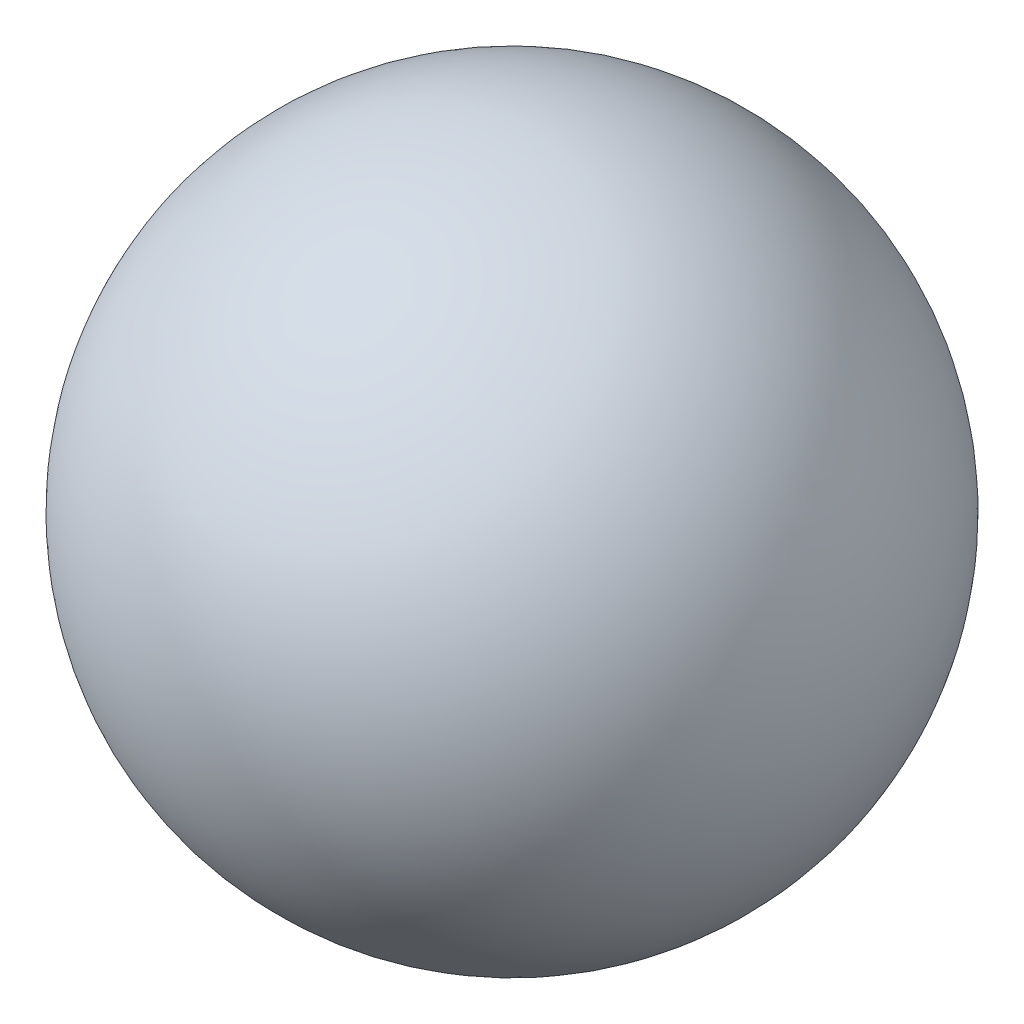
ISO-10303-21;
HEADER;
FILE_DESCRIPTION(('STEP AP214'),'2;1');
FILE_NAME('part.step','',(''),(''),'','','');
FILE_SCHEMA(('AUTOMOTIVE_DESIGN { 1 0 10303 214 1 1 1 1 }'));
ENDSEC;
DATA;
#1=APPLICATION_CONTEXT('core data for automotive mechanical design processes');
#2=APPLICATION_PROTOCOL_DEFINITION('international standard','automotive_design',2000,#1);
#3=PRODUCT_CONTEXT('',#1,'mechanical');
#4=PRODUCT('Part','Part','',(#3));
#5=PRODUCT_RELATED_PRODUCT_CATEGORY('part','',(#4));
#6=PRODUCT_DEFINITION_FORMATION('','',#4);
#7=PRODUCT_DEFINITION_CONTEXT('part definition',#1,'design');
#8=PRODUCT_DEFINITION('design','',#6,#7);
#9=PRODUCT_DEFINITION_SHAPE('','',#8);
#10=(LENGTH_UNIT() NAMED_UNIT(*) SI_UNIT(.MILLI.,.METRE.));
#11=(NAMED_UNIT(*) PLANE_ANGLE_UNIT() SI_UNIT($,.RADIAN.));
#12=(NAMED_UNIT(*) SI_UNIT($,.STERADIAN.) SOLID_ANGLE_UNIT());
#13=UNCERTAINTY_MEASURE_WITH_UNIT(LENGTH_MEASURE(1.E-05),#10,'distance_accuracy_value','');
#14=(GEOMETRIC_REPRESENTATION_CONTEXT(3) GLOBAL_UNCERTAINTY_ASSIGNED_CONTEXT((#13)) GLOBAL_UNIT_ASSIGNED_CONTEXT((#10,
#11,#12)) REPRESENTATION_CONTEXT('',''));
#15=CARTESIAN_POINT('',(0.,0.,0.));
#16=DIRECTION('',(0.,0.,1.));
#17=DIRECTION('',(1.,0.,0.));
#18=AXIS2_PLACEMENT_3D('',#15,#16,#17);
#19=CARTESIAN_POINT('',(0.,0.,0.));
#20=DIRECTION('',(-1.,0.,0.));
#21=DIRECTION('',(0.,0.,-1.));
#22=AXIS2_PLACEMENT_3D('',#19,#20,#21);
#23=SPHERICAL_SURFACE('',#22,6.35);
#24=CARTESIAN_POINT('',(-6.35,0.,0.));
#25=VERTEX_POINT('',#24);
#26=VERTEX_LOOP('',#25);
#27=FACE_BOUND('',#26,.T.);
#28=ADVANCED_FACE('F29',(#27),#23,.T.);
#29=CLOSED_SHELL('',(#28));
#30=MANIFOLD_SOLID_BREP('B2',#29);
#31=ADVANCED_BREP_SHAPE_REPRESENTATION('',(#18,#30),#14);
#32=SHAPE_DEFINITION_REPRESENTATION(#9,#31);
ENDSEC;
END-ISO-10303-21;
